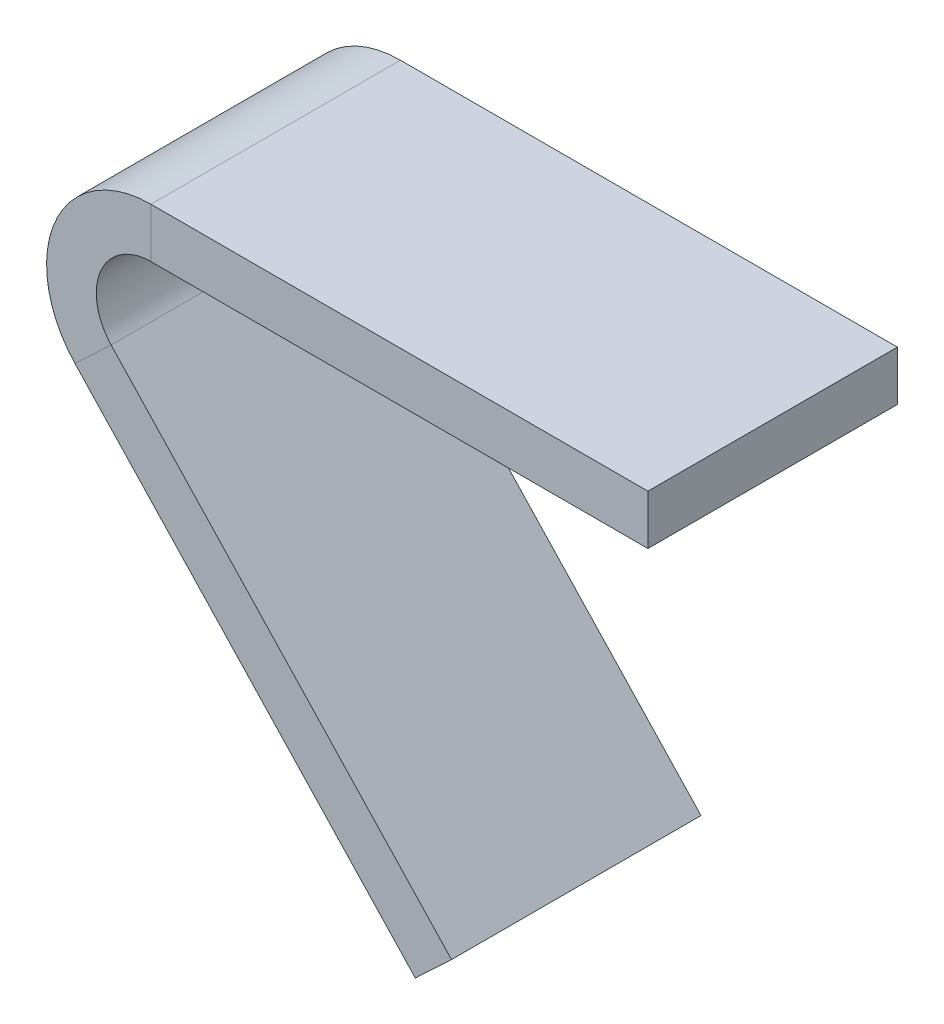
ISO-10303-21;
HEADER;
FILE_DESCRIPTION(('STEP AP214'),'2;1');
FILE_NAME('part.step','',(''),(''),'','','');
FILE_SCHEMA(('AUTOMOTIVE_DESIGN { 1 0 10303 214 1 1 1 1 }'));
ENDSEC;
DATA;
#1=APPLICATION_CONTEXT('core data for automotive mechanical design processes');
#2=APPLICATION_PROTOCOL_DEFINITION('international standard','automotive_design',2000,#1);
#3=PRODUCT_CONTEXT('',#1,'mechanical');
#4=PRODUCT('Part','Part','',(#3));
#5=PRODUCT_RELATED_PRODUCT_CATEGORY('part','',(#4));
#6=PRODUCT_DEFINITION_FORMATION('','',#4);
#7=PRODUCT_DEFINITION_CONTEXT('part definition',#1,'design');
#8=PRODUCT_DEFINITION('design','',#6,#7);
#9=PRODUCT_DEFINITION_SHAPE('','',#8);
#10=(LENGTH_UNIT() NAMED_UNIT(*) SI_UNIT(.MILLI.,.METRE.));
#11=(NAMED_UNIT(*) PLANE_ANGLE_UNIT() SI_UNIT($,.RADIAN.));
#12=(NAMED_UNIT(*) SI_UNIT($,.STERADIAN.) SOLID_ANGLE_UNIT());
#13=UNCERTAINTY_MEASURE_WITH_UNIT(LENGTH_MEASURE(1.E-05),#10,'distance_accuracy_value','');
#14=(GEOMETRIC_REPRESENTATION_CONTEXT(3) GLOBAL_UNCERTAINTY_ASSIGNED_CONTEXT((#13)) GLOBAL_UNIT_ASSIGNED_CONTEXT((#10,
#11,#12)) REPRESENTATION_CONTEXT('',''));
#15=CARTESIAN_POINT('',(0.,0.,0.));
#16=DIRECTION('',(0.,0.,1.));
#17=DIRECTION('',(1.,0.,0.));
#18=AXIS2_PLACEMENT_3D('',#15,#16,#17);
#19=CARTESIAN_POINT('',(5.53182101094826,-5.88461348180156,15.9385));
#20=DIRECTION('',(0.,0.,1.));
#21=DIRECTION('',(1.,0.,0.));
#22=AXIS2_PLACEMENT_3D('',#19,#20,#21);
#23=PLANE('',#22);
#24=DIRECTION('',(-0.728610099485844,-0.684928699155779,0.));
#25=VECTOR('',#24,1.);
#26=CARTESIAN_POINT('',(5.53182101094826,-5.88461348180156,15.9385));
#27=LINE('',#26,#25);
#28=CARTESIAN_POINT('',(5.53182101094826,-5.88461348180156,15.9385));
#29=VERTEX_POINT('',#28);
#30=CARTESIAN_POINT('',(3.21848394508071,-8.05926210162116,15.9385));
#31=VERTEX_POINT('',#30);
#32=EDGE_CURVE('E11',#29,#31,#27,.T.);
#33=ORIENTED_EDGE('',*,*,#32,.F.);
#34=CARTESIAN_POINT('',(8.07649178340258,-3.4925,15.9385));
#35=DIRECTION('',(0.,0.,-1.));
#36=DIRECTION('',(-1.,0.,0.));
#37=AXIS2_PLACEMENT_3D('',#34,#35,#36);
#38=CIRCLE('',#37,3.4925);
#39=CARTESIAN_POINT('',(8.07649178340258,0.,15.9385));
#40=VERTEX_POINT('',#39);
#41=EDGE_CURVE('E136',#40,#29,#38,.F.);
#42=ORIENTED_EDGE('',*,*,#41,.F.);
#43=DIRECTION('',(0.,-1.,0.));
#44=VECTOR('',#43,1.);
#45=CARTESIAN_POINT('',(8.07649178340258,3.175,15.9385));
#46=LINE('',#45,#44);
#47=CARTESIAN_POINT('',(8.07649178340258,3.175,15.9385));
#48=VERTEX_POINT('',#47);
#49=EDGE_CURVE('E47',#48,#40,#46,.T.);
#50=ORIENTED_EDGE('',*,*,#49,.F.);
#51=CARTESIAN_POINT('',(8.07649178340258,-3.4925,15.9385));
#52=DIRECTION('',(0.,0.,1.));
#53=DIRECTION('',(1.,0.,0.));
#54=AXIS2_PLACEMENT_3D('',#51,#52,#53);
#55=CIRCLE('',#54,6.6675);
#56=EDGE_CURVE('E129',#48,#31,#55,.T.);
#57=ORIENTED_EDGE('',*,*,#56,.T.);
#58=EDGE_LOOP('',(#33,#42,#50,#57));
#59=FACE_BOUND('',#58,.T.);
#60=ADVANCED_FACE('F39',(#59),#23,.T.);
#61=CARTESIAN_POINT('',(8.07649178340258,3.175,15.9385));
#62=DIRECTION('',(0.,0.,1.));
#63=DIRECTION('',(1.,0.,0.));
#64=AXIS2_PLACEMENT_3D('',#61,#62,#63);
#65=PLANE('',#64);
#66=DIRECTION('',(0.684928699155779,-0.728610099485845,0.));
#67=VECTOR('',#66,1.);
#68=CARTESIAN_POINT('',(0.,0.,15.9385));
#69=LINE('',#68,#67);
#70=CARTESIAN_POINT('',(27.278792287017,-29.0185001542426,15.9385));
#71=VERTEX_POINT('',#70);
#72=EDGE_CURVE('E185',#29,#71,#69,.T.);
#73=ORIENTED_EDGE('',*,*,#72,.F.);
#74=ORIENTED_EDGE('',*,*,#32,.T.);
#75=DIRECTION('',(0.684928699155779,-0.728610099485845,0.));
#76=VECTOR('',#75,1.);
#77=CARTESIAN_POINT('',(-2.31333706586756,-2.1746486198196,15.9385));
#78=LINE('',#77,#76);
#79=CARTESIAN_POINT('',(24.9654552211495,-31.1931487740622,15.9385));
#80=VERTEX_POINT('',#79);
#81=EDGE_CURVE('E95',#31,#80,#78,.T.);
#82=ORIENTED_EDGE('',*,*,#81,.T.);
#83=DIRECTION('',(-0.728610099485845,-0.684928699155779,0.));
#84=VECTOR('',#83,1.);
#85=CARTESIAN_POINT('',(27.278792287017,-29.0185001542426,15.9385));
#86=LINE('',#85,#84);
#87=EDGE_CURVE('E342',#71,#80,#86,.T.);
#88=ORIENTED_EDGE('',*,*,#87,.F.);
#89=EDGE_LOOP('',(#73,#74,#82,#88));
#90=FACE_BOUND('',#89,.T.);
#91=ADVANCED_FACE('F193',(#90),#65,.T.);
#92=CARTESIAN_POINT('',(8.07649178340258,0.,0.));
#93=DIRECTION('',(0.,0.,-1.));
#94=DIRECTION('',(-1.,0.,0.));
#95=AXIS2_PLACEMENT_3D('',#92,#93,#94);
#96=PLANE('',#95);
#97=DIRECTION('',(0.,1.,0.));
#98=VECTOR('',#97,1.);
#99=CARTESIAN_POINT('',(8.07649178340258,0.,0.));
#100=LINE('',#99,#98);
#101=CARTESIAN_POINT('',(8.07649178340258,0.,0.));
#102=VERTEX_POINT('',#101);
#103=CARTESIAN_POINT('',(8.07649178340258,3.175,0.));
#104=VERTEX_POINT('',#103);
#105=EDGE_CURVE('E82',#102,#104,#100,.T.);
#106=ORIENTED_EDGE('',*,*,#105,.F.);
#107=CARTESIAN_POINT('',(8.07649178340258,-3.4925,0.));
#108=DIRECTION('',(0.,0.,-1.));
#109=DIRECTION('',(-1.,0.,0.));
#110=AXIS2_PLACEMENT_3D('',#107,#108,#109);
#111=CIRCLE('',#110,3.4925);
#112=CARTESIAN_POINT('',(5.53182101094826,-5.88461348180156,0.));
#113=VERTEX_POINT('',#112);
#114=EDGE_CURVE('E151',#102,#113,#111,.F.);
#115=ORIENTED_EDGE('',*,*,#114,.T.);
#116=DIRECTION('',(0.728610099485844,0.684928699155779,0.));
#117=VECTOR('',#116,1.);
#118=CARTESIAN_POINT('',(3.21848394508071,-8.05926210162116,0.));
#119=LINE('',#118,#117);
#120=CARTESIAN_POINT('',(3.21848394508071,-8.05926210162116,0.));
#121=VERTEX_POINT('',#120);
#122=EDGE_CURVE('E89',#121,#113,#119,.T.);
#123=ORIENTED_EDGE('',*,*,#122,.F.);
#124=CARTESIAN_POINT('',(8.07649178340258,-3.4925,0.));
#125=DIRECTION('',(0.,0.,1.));
#126=DIRECTION('',(1.,0.,0.));
#127=AXIS2_PLACEMENT_3D('',#124,#125,#126);
#128=CIRCLE('',#127,6.6675);
#129=EDGE_CURVE('E158',#104,#121,#128,.T.);
#130=ORIENTED_EDGE('',*,*,#129,.F.);
#131=EDGE_LOOP('',(#106,#115,#123,#130));
#132=FACE_BOUND('',#131,.T.);
#133=ADVANCED_FACE('F191',(#132),#96,.T.);
#134=CARTESIAN_POINT('',(3.21848394508071,-8.05926210162116,0.));
#135=DIRECTION('',(0.,0.,-1.));
#136=DIRECTION('',(-1.,0.,0.));
#137=AXIS2_PLACEMENT_3D('',#134,#135,#136);
#138=PLANE('',#137);
#139=DIRECTION('',(-1.,0.,0.));
#140=VECTOR('',#139,1.);
#141=CARTESIAN_POINT('',(0.,0.,0.));
#142=LINE('',#141,#140);
#143=CARTESIAN_POINT('',(39.8272,0.,0.));
#144=VERTEX_POINT('',#143);
#145=EDGE_CURVE('E153',#144,#102,#142,.T.);
#146=ORIENTED_EDGE('',*,*,#145,.T.);
#147=ORIENTED_EDGE('',*,*,#105,.T.);
#148=DIRECTION('',(1.,0.,0.));
#149=VECTOR('',#148,1.);
#150=CARTESIAN_POINT('',(0.,3.175,0.));
#151=LINE('',#150,#149);
#152=CARTESIAN_POINT('',(39.8272,3.175,0.));
#153=VERTEX_POINT('',#152);
#154=EDGE_CURVE('E156',#153,#104,#151,.F.);
#155=ORIENTED_EDGE('',*,*,#154,.F.);
#156=DIRECTION('',(0.,-1.,0.));
#157=VECTOR('',#156,1.);
#158=CARTESIAN_POINT('',(39.8272,3.175,0.));
#159=LINE('',#158,#157);
#160=EDGE_CURVE('E117',#153,#144,#159,.T.);
#161=ORIENTED_EDGE('',*,*,#160,.T.);
#162=EDGE_LOOP('',(#146,#147,#155,#161));
#163=FACE_BOUND('',#162,.T.);
#164=ADVANCED_FACE('F187',(#163),#138,.T.);
#165=CARTESIAN_POINT('',(-2.31333706586756,-2.1746486198196,15.9385));
#166=DIRECTION('',(0.728610099485845,0.684928699155779,0.));
#167=DIRECTION('',(-0.684928699155779,0.728610099485845,0.));
#168=AXIS2_PLACEMENT_3D('',#165,#166,#167);
#169=PLANE('',#168);
#170=DIRECTION('',(0.684928699155779,-0.728610099485845,0.));
#171=VECTOR('',#170,1.);
#172=CARTESIAN_POINT('',(-2.31333706586756,-2.1746486198196,0.));
#173=LINE('',#172,#171);
#174=CARTESIAN_POINT('',(24.9654552211495,-31.1931487740622,0.));
#175=VERTEX_POINT('',#174);
#176=EDGE_CURVE('E142',#121,#175,#173,.T.);
#177=ORIENTED_EDGE('',*,*,#176,.T.);
#178=DIRECTION('',(0.,0.,-1.));
#179=VECTOR('',#178,1.);
#180=CARTESIAN_POINT('',(24.9654552211495,-31.1931487740622,15.9385));
#181=LINE('',#180,#179);
#182=EDGE_CURVE('E172',#80,#175,#181,.T.);
#183=ORIENTED_EDGE('',*,*,#182,.F.);
#184=ORIENTED_EDGE('',*,*,#81,.F.);
#185=DIRECTION('',(0.,0.,-1.));
#186=VECTOR('',#185,1.);
#187=CARTESIAN_POINT('',(3.21848394508071,-8.05926210162116,15.9385));
#188=LINE('',#187,#186);
#189=EDGE_CURVE('E141',#31,#121,#188,.T.);
#190=ORIENTED_EDGE('',*,*,#189,.T.);
#191=EDGE_LOOP('',(#177,#183,#184,#190));
#192=FACE_BOUND('',#191,.T.);
#193=ADVANCED_FACE('F199',(#192),#169,.F.);
#194=CARTESIAN_POINT('',(27.278792287017,-29.0185001542426,15.9385));
#195=DIRECTION('',(0.684928699155779,-0.728610099485845,0.));
#196=DIRECTION('',(0.728610099485845,0.684928699155779,0.));
#197=AXIS2_PLACEMENT_3D('',#194,#195,#196);
#198=PLANE('',#197);
#199=DIRECTION('',(-0.728610099485845,-0.684928699155779,0.));
#200=VECTOR('',#199,1.);
#201=CARTESIAN_POINT('',(27.278792287017,-29.0185001542426,0.));
#202=LINE('',#201,#200);
#203=CARTESIAN_POINT('',(27.278792287017,-29.0185001542426,0.));
#204=VERTEX_POINT('',#203);
#205=EDGE_CURVE('E145',#204,#175,#202,.T.);
#206=ORIENTED_EDGE('',*,*,#205,.F.);
#207=DIRECTION('',(0.,0.,-1.));
#208=VECTOR('',#207,1.);
#209=CARTESIAN_POINT('',(27.278792287017,-29.0185001542426,15.9385));
#210=LINE('',#209,#208);
#211=EDGE_CURVE('E170',#71,#204,#210,.T.);
#212=ORIENTED_EDGE('',*,*,#211,.F.);
#213=ORIENTED_EDGE('',*,*,#87,.T.);
#214=ORIENTED_EDGE('',*,*,#182,.T.);
#215=EDGE_LOOP('',(#206,#212,#213,#214));
#216=FACE_BOUND('',#215,.T.);
#217=ADVANCED_FACE('F230',(#216),#198,.T.);
#218=CARTESIAN_POINT('',(0.,0.,15.9385));
#219=DIRECTION('',(0.728610099485845,0.684928699155779,0.));
#220=DIRECTION('',(-0.684928699155779,0.728610099485845,0.));
#221=AXIS2_PLACEMENT_3D('',#218,#219,#220);
#222=PLANE('',#221);
#223=DIRECTION('',(0.684928699155779,-0.728610099485845,0.));
#224=VECTOR('',#223,1.);
#225=CARTESIAN_POINT('',(0.,0.,0.));
#226=LINE('',#225,#224);
#227=EDGE_CURVE('E148',#113,#204,#226,.T.);
#228=ORIENTED_EDGE('',*,*,#227,.F.);
#229=DIRECTION('',(0.,0.,-1.));
#230=VECTOR('',#229,1.);
#231=CARTESIAN_POINT('',(5.53182101094826,-5.88461348180156,15.9385));
#232=LINE('',#231,#230);
#233=EDGE_CURVE('E167',#29,#113,#232,.T.);
#234=ORIENTED_EDGE('',*,*,#233,.F.);
#235=ORIENTED_EDGE('',*,*,#72,.T.);
#236=ORIENTED_EDGE('',*,*,#211,.T.);
#237=EDGE_LOOP('',(#228,#234,#235,#236));
#238=FACE_BOUND('',#237,.T.);
#239=ADVANCED_FACE('F241',(#238),#222,.T.);
#240=CARTESIAN_POINT('',(8.07649178340258,-3.4925,15.9385));
#241=DIRECTION('',(0.,0.,-1.));
#242=DIRECTION('',(-1.,0.,0.));
#243=AXIS2_PLACEMENT_3D('',#240,#241,#242);
#244=CYLINDRICAL_SURFACE('',#243,3.4925);
#245=ORIENTED_EDGE('',*,*,#114,.F.);
#246=DIRECTION('',(0.,0.,-1.));
#247=VECTOR('',#246,1.);
#248=CARTESIAN_POINT('',(8.07649178340258,0.,15.9385));
#249=LINE('',#248,#247);
#250=EDGE_CURVE('E164',#40,#102,#249,.T.);
#251=ORIENTED_EDGE('',*,*,#250,.F.);
#252=ORIENTED_EDGE('',*,*,#41,.T.);
#253=ORIENTED_EDGE('',*,*,#233,.T.);
#254=EDGE_LOOP('',(#245,#251,#252,#253));
#255=FACE_BOUND('',#254,.T.);
#256=ADVANCED_FACE('F181',(#255),#244,.F.);
#257=CARTESIAN_POINT('',(0.,0.,15.9385));
#258=DIRECTION('',(0.,-1.,0.));
#259=DIRECTION('',(0.,0.,-1.));
#260=AXIS2_PLACEMENT_3D('',#257,#258,#259);
#261=PLANE('',#260);
#262=ORIENTED_EDGE('',*,*,#145,.F.);
#263=DIRECTION('',(0.,0.,-1.));
#264=VECTOR('',#263,1.);
#265=CARTESIAN_POINT('',(39.8272,0.,15.9385));
#266=LINE('',#265,#264);
#267=CARTESIAN_POINT('',(39.8272,0.,15.9385));
#268=VERTEX_POINT('',#267);
#269=EDGE_CURVE('E119',#268,#144,#266,.T.);
#270=ORIENTED_EDGE('',*,*,#269,.F.);
#271=DIRECTION('',(-1.,0.,0.));
#272=VECTOR('',#271,1.);
#273=CARTESIAN_POINT('',(0.,0.,15.9385));
#274=LINE('',#273,#272);
#275=EDGE_CURVE('E134',#268,#40,#274,.T.);
#276=ORIENTED_EDGE('',*,*,#275,.T.);
#277=ORIENTED_EDGE('',*,*,#250,.T.);
#278=EDGE_LOOP('',(#262,#270,#276,#277));
#279=FACE_BOUND('',#278,.T.);
#280=ADVANCED_FACE('F186',(#279),#261,.T.);
#281=CARTESIAN_POINT('',(39.8272,3.175,15.9385));
#282=DIRECTION('',(1.,0.,0.));
#283=DIRECTION('',(0.,0.,-1.));
#284=AXIS2_PLACEMENT_3D('',#281,#282,#283);
#285=PLANE('',#284);
#286=ORIENTED_EDGE('',*,*,#160,.F.);
#287=DIRECTION('',(0.,0.,-1.));
#288=VECTOR('',#287,1.);
#289=CARTESIAN_POINT('',(39.8272,3.175,15.9385));
#290=LINE('',#289,#288);
#291=CARTESIAN_POINT('',(39.8272,3.175,15.9385));
#292=VERTEX_POINT('',#291);
#293=EDGE_CURVE('E111',#292,#153,#290,.T.);
#294=ORIENTED_EDGE('',*,*,#293,.F.);
#295=DIRECTION('',(0.,-1.,0.));
#296=VECTOR('',#295,1.);
#297=CARTESIAN_POINT('',(39.8272,3.175,15.9385));
#298=LINE('',#297,#296);
#299=EDGE_CURVE('E115',#292,#268,#298,.T.);
#300=ORIENTED_EDGE('',*,*,#299,.T.);
#301=ORIENTED_EDGE('',*,*,#269,.T.);
#302=EDGE_LOOP('',(#286,#294,#300,#301));
#303=FACE_BOUND('',#302,.T.);
#304=ADVANCED_FACE('F113',(#303),#285,.T.);
#305=CARTESIAN_POINT('',(0.,3.175,15.9385));
#306=DIRECTION('',(0.,-1.,0.));
#307=DIRECTION('',(0.,0.,-1.));
#308=AXIS2_PLACEMENT_3D('',#305,#306,#307);
#309=PLANE('',#308);
#310=ORIENTED_EDGE('',*,*,#154,.T.);
#311=DIRECTION('',(0.,0.,-1.));
#312=VECTOR('',#311,1.);
#313=CARTESIAN_POINT('',(8.07649178340258,3.175,15.9385));
#314=LINE('',#313,#312);
#315=EDGE_CURVE('E120',#48,#104,#314,.T.);
#316=ORIENTED_EDGE('',*,*,#315,.F.);
#317=DIRECTION('',(1.,0.,0.));
#318=VECTOR('',#317,1.);
#319=CARTESIAN_POINT('',(0.,3.175,15.9385));
#320=LINE('',#319,#318);
#321=EDGE_CURVE('E124',#292,#48,#320,.F.);
#322=ORIENTED_EDGE('',*,*,#321,.F.);
#323=ORIENTED_EDGE('',*,*,#293,.T.);
#324=EDGE_LOOP('',(#310,#316,#322,#323));
#325=FACE_BOUND('',#324,.T.);
#326=ADVANCED_FACE('F125',(#325),#309,.F.);
#327=CARTESIAN_POINT('',(8.07649178340258,-3.4925,15.9385));
#328=DIRECTION('',(0.,0.,-1.));
#329=DIRECTION('',(-1.,0.,0.));
#330=AXIS2_PLACEMENT_3D('',#327,#328,#329);
#331=CYLINDRICAL_SURFACE('',#330,6.6675);
#332=ORIENTED_EDGE('',*,*,#129,.T.);
#333=ORIENTED_EDGE('',*,*,#189,.F.);
#334=ORIENTED_EDGE('',*,*,#56,.F.);
#335=ORIENTED_EDGE('',*,*,#315,.T.);
#336=EDGE_LOOP('',(#332,#333,#334,#335));
#337=FACE_BOUND('',#336,.T.);
#338=ADVANCED_FACE('F189',(#337),#331,.T.);
#339=CARTESIAN_POINT('',(8.07649178340258,-3.4925,15.9385));
#340=DIRECTION('',(0.,0.,-1.));
#341=DIRECTION('',(-1.,0.,0.));
#342=AXIS2_PLACEMENT_3D('',#339,#340,#341);
#343=PLANE('',#342);
#344=ORIENTED_EDGE('',*,*,#321,.T.);
#345=ORIENTED_EDGE('',*,*,#49,.T.);
#346=ORIENTED_EDGE('',*,*,#275,.F.);
#347=ORIENTED_EDGE('',*,*,#299,.F.);
#348=EDGE_LOOP('',(#344,#345,#346,#347));
#349=FACE_BOUND('',#348,.T.);
#350=ADVANCED_FACE('F132',(#349),#343,.F.);
#351=CARTESIAN_POINT('',(8.07649178340258,-3.4925,0.));
#352=DIRECTION('',(0.,0.,-1.));
#353=DIRECTION('',(-1.,0.,0.));
#354=AXIS2_PLACEMENT_3D('',#351,#352,#353);
#355=PLANE('',#354);
#356=ORIENTED_EDGE('',*,*,#176,.F.);
#357=ORIENTED_EDGE('',*,*,#122,.T.);
#358=ORIENTED_EDGE('',*,*,#227,.T.);
#359=ORIENTED_EDGE('',*,*,#205,.T.);
#360=EDGE_LOOP('',(#356,#357,#358,#359));
#361=FACE_BOUND('',#360,.T.);
#362=ADVANCED_FACE('F307',(#361),#355,.T.);
#363=CLOSED_SHELL('',(#60,#91,#133,#164,#193,#217,#239,#256,#280,#304,#326,#338,#350,#362));
#364=MANIFOLD_SOLID_BREP('B2',#363);
#365=ADVANCED_BREP_SHAPE_REPRESENTATION('',(#18,#364),#14);
#366=SHAPE_DEFINITION_REPRESENTATION(#9,#365);
ENDSEC;
END-ISO-10303-21;
